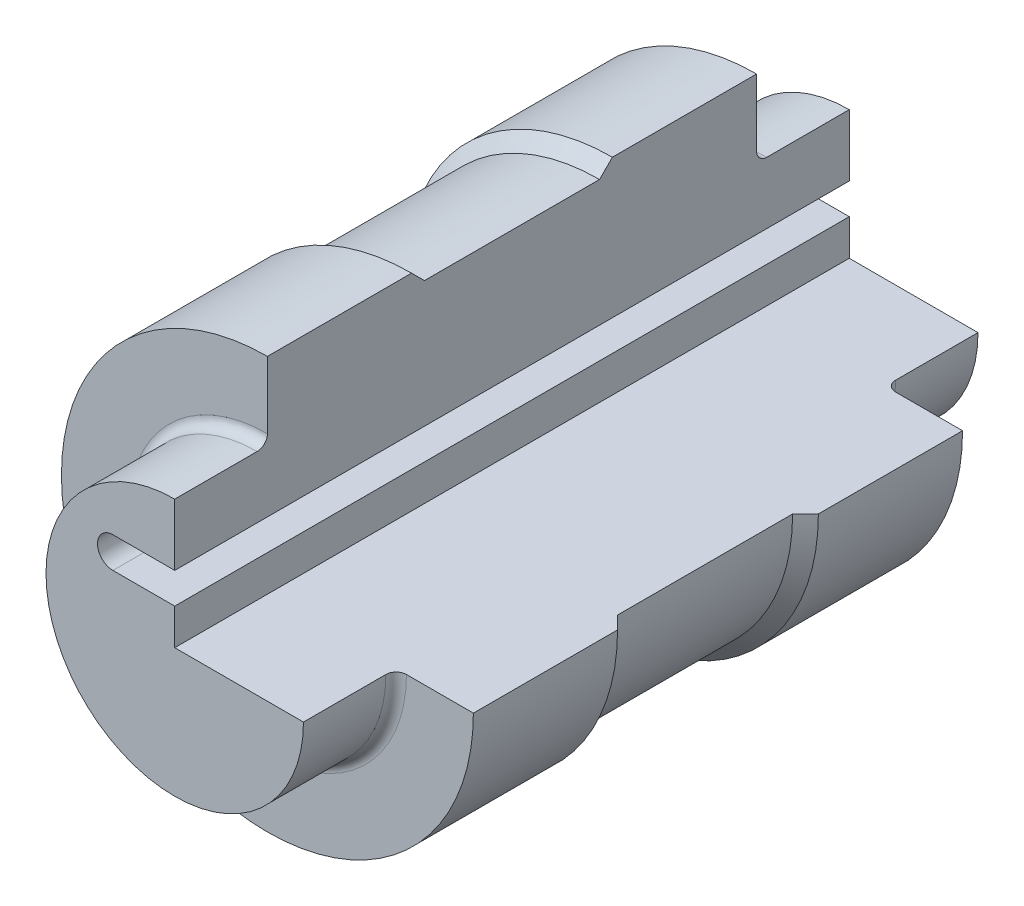
ISO-10303-21;
HEADER;
FILE_DESCRIPTION(('STEP AP214'),'2;1');
FILE_NAME('part.step','',(''),(''),'','','');
FILE_SCHEMA(('AUTOMOTIVE_DESIGN { 1 0 10303 214 1 1 1 1 }'));
ENDSEC;
DATA;
#1=APPLICATION_CONTEXT('core data for automotive mechanical design processes');
#2=APPLICATION_PROTOCOL_DEFINITION('international standard','automotive_design',2000,#1);
#3=PRODUCT_CONTEXT('',#1,'mechanical');
#4=PRODUCT('Part','Part','',(#3));
#5=PRODUCT_RELATED_PRODUCT_CATEGORY('part','',(#4));
#6=PRODUCT_DEFINITION_FORMATION('','',#4);
#7=PRODUCT_DEFINITION_CONTEXT('part definition',#1,'design');
#8=PRODUCT_DEFINITION('design','',#6,#7);
#9=PRODUCT_DEFINITION_SHAPE('','',#8);
#10=(LENGTH_UNIT() NAMED_UNIT(*) SI_UNIT(.MILLI.,.METRE.));
#11=(NAMED_UNIT(*) PLANE_ANGLE_UNIT() SI_UNIT($,.RADIAN.));
#12=(NAMED_UNIT(*) SI_UNIT($,.STERADIAN.) SOLID_ANGLE_UNIT());
#13=UNCERTAINTY_MEASURE_WITH_UNIT(LENGTH_MEASURE(1.E-05),#10,'distance_accuracy_value','');
#14=(GEOMETRIC_REPRESENTATION_CONTEXT(3) GLOBAL_UNCERTAINTY_ASSIGNED_CONTEXT((#13)) GLOBAL_UNIT_ASSIGNED_CONTEXT((#10,
#11,#12)) REPRESENTATION_CONTEXT('',''));
#15=CARTESIAN_POINT('',(0.,0.,0.));
#16=DIRECTION('',(0.,0.,1.));
#17=DIRECTION('',(1.,0.,0.));
#18=AXIS2_PLACEMENT_3D('',#15,#16,#17);
#19=CARTESIAN_POINT('',(0.,0.,-65.5));
#20=DIRECTION('',(0.,0.,-1.));
#21=DIRECTION('',(0.,1.,0.));
#22=AXIS2_PLACEMENT_3D('',#19,#20,#21);
#23=CYLINDRICAL_SURFACE('',#22,25.);
#24=DIRECTION('',(0.,0.,-1.));
#25=VECTOR('',#24,1.);
#26=CARTESIAN_POINT('',(0.,25.,-65.5));
#27=LINE('',#26,#25);
#28=CARTESIAN_POINT('',(0.,25.,-65.5));
#29=VERTEX_POINT('',#28);
#30=CARTESIAN_POINT('',(0.,25.,-49.5));
#31=VERTEX_POINT('',#30);
#32=EDGE_CURVE('E269',#29,#31,#27,.F.);
#33=ORIENTED_EDGE('',*,*,#32,.F.);
#34=CARTESIAN_POINT('',(0.,0.,-65.5));
#35=DIRECTION('',(0.,0.,-1.));
#36=DIRECTION('',(0.,1.,0.));
#37=AXIS2_PLACEMENT_3D('',#34,#35,#36);
#38=CIRCLE('',#37,25.);
#39=CARTESIAN_POINT('',(25.,0.,-65.5));
#40=VERTEX_POINT('',#39);
#41=EDGE_CURVE('E331',#40,#29,#38,.T.);
#42=ORIENTED_EDGE('',*,*,#41,.F.);
#43=DIRECTION('',(0.,0.,-1.));
#44=VECTOR('',#43,1.);
#45=CARTESIAN_POINT('',(25.,0.,-65.5));
#46=LINE('',#45,#44);
#47=CARTESIAN_POINT('',(25.,0.,-49.5));
#48=VERTEX_POINT('',#47);
#49=EDGE_CURVE('E245',#48,#40,#46,.T.);
#50=ORIENTED_EDGE('',*,*,#49,.F.);
#51=CARTESIAN_POINT('',(0.,0.,-49.5));
#52=DIRECTION('',(0.,0.,-1.));
#53=DIRECTION('',(0.,1.,0.));
#54=AXIS2_PLACEMENT_3D('',#51,#52,#53);
#55=CIRCLE('',#54,25.);
#56=EDGE_CURVE('E289',#48,#31,#55,.T.);
#57=ORIENTED_EDGE('',*,*,#56,.T.);
#58=EDGE_LOOP('',(#33,#42,#50,#57));
#59=FACE_BOUND('',#58,.T.);
#60=ADVANCED_FACE('F41',(#59),#23,.T.);
#61=CARTESIAN_POINT('',(0.,0.,-65.5));
#62=DIRECTION('',(0.,0.,-1.));
#63=DIRECTION('',(0.,1.,0.));
#64=AXIS2_PLACEMENT_3D('',#61,#62,#63);
#65=PLANE('',#64);
#66=DIRECTION('',(0.,-1.,0.));
#67=VECTOR('',#66,1.);
#68=CARTESIAN_POINT('',(0.,40.,-65.5));
#69=LINE('',#68,#67);
#70=CARTESIAN_POINT('',(0.,13.,-65.5));
#71=VERTEX_POINT('',#70);
#72=EDGE_CURVE('E208',#29,#71,#69,.T.);
#73=ORIENTED_EDGE('',*,*,#72,.T.);
#74=DIRECTION('',(-1.,0.,0.));
#75=VECTOR('',#74,1.);
#76=CARTESIAN_POINT('',(-12.,13.,-65.5));
#77=LINE('',#76,#75);
#78=CARTESIAN_POINT('',(-12.,13.,-65.5));
#79=VERTEX_POINT('',#78);
#80=EDGE_CURVE('E212',#71,#79,#77,.T.);
#81=ORIENTED_EDGE('',*,*,#80,.T.);
#82=CARTESIAN_POINT('',(-12.,10.,-65.5));
#83=DIRECTION('',(0.,0.,1.));
#84=DIRECTION('',(1.,0.,0.));
#85=AXIS2_PLACEMENT_3D('',#82,#83,#84);
#86=CIRCLE('',#85,3.);
#87=CARTESIAN_POINT('',(-12.,7.,-65.5));
#88=VERTEX_POINT('',#87);
#89=EDGE_CURVE('E216',#79,#88,#86,.T.);
#90=ORIENTED_EDGE('',*,*,#89,.T.);
#91=DIRECTION('',(1.,0.,0.));
#92=VECTOR('',#91,1.);
#93=CARTESIAN_POINT('',(-12.,7.,-65.5));
#94=LINE('',#93,#92);
#95=CARTESIAN_POINT('',(0.,7.,-65.5));
#96=VERTEX_POINT('',#95);
#97=EDGE_CURVE('E170',#88,#96,#94,.T.);
#98=ORIENTED_EDGE('',*,*,#97,.T.);
#99=DIRECTION('',(0.,-1.,0.));
#100=VECTOR('',#99,1.);
#101=CARTESIAN_POINT('',(0.,7.,-65.5));
#102=LINE('',#101,#100);
#103=CARTESIAN_POINT('',(0.,0.,-65.5));
#104=VERTEX_POINT('',#103);
#105=EDGE_CURVE('E203',#96,#104,#102,.T.);
#106=ORIENTED_EDGE('',*,*,#105,.T.);
#107=DIRECTION('',(1.,0.,0.));
#108=VECTOR('',#107,1.);
#109=CARTESIAN_POINT('',(0.,0.,-65.5));
#110=LINE('',#109,#108);
#111=EDGE_CURVE('E164',#104,#40,#110,.T.);
#112=ORIENTED_EDGE('',*,*,#111,.T.);
#113=ORIENTED_EDGE('',*,*,#41,.T.);
#114=EDGE_LOOP('',(#73,#81,#90,#98,#106,#112,#113));
#115=FACE_BOUND('',#114,.T.);
#116=ADVANCED_FACE('F393',(#115),#65,.T.);
#117=CARTESIAN_POINT('',(0.,0.,65.5));
#118=DIRECTION('',(0.,0.,1.));
#119=DIRECTION('',(0.,-1.,0.));
#120=AXIS2_PLACEMENT_3D('',#117,#118,#119);
#121=PLANE('',#120);
#122=DIRECTION('',(0.,-1.,0.));
#123=VECTOR('',#122,1.);
#124=CARTESIAN_POINT('',(0.,40.,65.5));
#125=LINE('',#124,#123);
#126=CARTESIAN_POINT('',(0.,25.,65.5));
#127=VERTEX_POINT('',#126);
#128=CARTESIAN_POINT('',(0.,13.,65.5));
#129=VERTEX_POINT('',#128);
#130=EDGE_CURVE('E187',#127,#129,#125,.T.);
#131=ORIENTED_EDGE('',*,*,#130,.F.);
#132=CARTESIAN_POINT('',(0.,0.,65.5));
#133=DIRECTION('',(0.,0.,-1.));
#134=DIRECTION('',(0.,1.,0.));
#135=AXIS2_PLACEMENT_3D('',#132,#133,#134);
#136=CIRCLE('',#135,25.);
#137=CARTESIAN_POINT('',(25.,0.,65.5));
#138=VERTEX_POINT('',#137);
#139=EDGE_CURVE('E185',#138,#127,#136,.T.);
#140=ORIENTED_EDGE('',*,*,#139,.F.);
#141=DIRECTION('',(1.,0.,0.));
#142=VECTOR('',#141,1.);
#143=CARTESIAN_POINT('',(0.,0.,65.5));
#144=LINE('',#143,#142);
#145=CARTESIAN_POINT('',(0.,0.,65.5));
#146=VERTEX_POINT('',#145);
#147=EDGE_CURVE('E161',#146,#138,#144,.T.);
#148=ORIENTED_EDGE('',*,*,#147,.F.);
#149=DIRECTION('',(0.,-1.,0.));
#150=VECTOR('',#149,1.);
#151=CARTESIAN_POINT('',(0.,7.,65.5));
#152=LINE('',#151,#150);
#153=CARTESIAN_POINT('',(0.,7.,65.5));
#154=VERTEX_POINT('',#153);
#155=EDGE_CURVE('E173',#154,#146,#152,.T.);
#156=ORIENTED_EDGE('',*,*,#155,.F.);
#157=DIRECTION('',(1.,0.,0.));
#158=VECTOR('',#157,1.);
#159=CARTESIAN_POINT('',(-12.,7.,65.5));
#160=LINE('',#159,#158);
#161=CARTESIAN_POINT('',(-12.,7.,65.5));
#162=VERTEX_POINT('',#161);
#163=EDGE_CURVE('E200',#162,#154,#160,.T.);
#164=ORIENTED_EDGE('',*,*,#163,.F.);
#165=CARTESIAN_POINT('',(-12.,10.,65.5));
#166=DIRECTION('',(0.,0.,1.));
#167=DIRECTION('',(1.,0.,0.));
#168=AXIS2_PLACEMENT_3D('',#165,#166,#167);
#169=CIRCLE('',#168,3.);
#170=CARTESIAN_POINT('',(-12.,13.,65.5));
#171=VERTEX_POINT('',#170);
#172=EDGE_CURVE('E196',#171,#162,#169,.T.);
#173=ORIENTED_EDGE('',*,*,#172,.F.);
#174=DIRECTION('',(-1.,0.,0.));
#175=VECTOR('',#174,1.);
#176=CARTESIAN_POINT('',(-12.,13.,65.5));
#177=LINE('',#176,#175);
#178=EDGE_CURVE('E190',#129,#171,#177,.T.);
#179=ORIENTED_EDGE('',*,*,#178,.F.);
#180=EDGE_LOOP('',(#131,#140,#148,#156,#164,#173,#179));
#181=FACE_BOUND('',#180,.T.);
#182=ADVANCED_FACE('F183',(#181),#121,.T.);
#183=CARTESIAN_POINT('',(0.,0.,-65.5));
#184=DIRECTION('',(0.,0.,-1.));
#185=DIRECTION('',(0.,1.,0.));
#186=AXIS2_PLACEMENT_3D('',#183,#184,#185);
#187=CYLINDRICAL_SURFACE('',#186,25.);
#188=DIRECTION('',(0.,0.,-1.));
#189=VECTOR('',#188,1.);
#190=CARTESIAN_POINT('',(0.,25.,-65.5));
#191=LINE('',#190,#189);
#192=CARTESIAN_POINT('',(0.,25.,49.5));
#193=VERTEX_POINT('',#192);
#194=EDGE_CURVE('E286',#193,#127,#191,.F.);
#195=ORIENTED_EDGE('',*,*,#194,.F.);
#196=CARTESIAN_POINT('',(0.,0.,49.5));
#197=DIRECTION('',(0.,0.,-1.));
#198=DIRECTION('',(0.,1.,0.));
#199=AXIS2_PLACEMENT_3D('',#196,#197,#198);
#200=CIRCLE('',#199,25.);
#201=CARTESIAN_POINT('',(25.,0.,49.5));
#202=VERTEX_POINT('',#201);
#203=EDGE_CURVE('E325',#202,#193,#200,.T.);
#204=ORIENTED_EDGE('',*,*,#203,.F.);
#205=DIRECTION('',(0.,0.,-1.));
#206=VECTOR('',#205,1.);
#207=CARTESIAN_POINT('',(25.,0.,-65.5));
#208=LINE('',#207,#206);
#209=EDGE_CURVE('E263',#138,#202,#208,.T.);
#210=ORIENTED_EDGE('',*,*,#209,.F.);
#211=ORIENTED_EDGE('',*,*,#139,.T.);
#212=EDGE_LOOP('',(#195,#204,#210,#211));
#213=FACE_BOUND('',#212,.T.);
#214=ADVANCED_FACE('F385',(#213),#187,.T.);
#215=CARTESIAN_POINT('',(0.,0.,49.5));
#216=DIRECTION('',(0.,0.,-1.));
#217=DIRECTION('',(0.,1.,0.));
#218=AXIS2_PLACEMENT_3D('',#215,#216,#217);
#219=TOROIDAL_SURFACE('',#218,27.,2.);
#220=CARTESIAN_POINT('',(0.,27.,49.5));
#221=DIRECTION('',(-1.,0.,0.));
#222=DIRECTION('',(0.,0.,1.));
#223=AXIS2_PLACEMENT_3D('',#220,#221,#222);
#224=CIRCLE('',#223,2.);
#225=CARTESIAN_POINT('',(0.,27.,47.5));
#226=VERTEX_POINT('',#225);
#227=EDGE_CURVE('E64',#226,#193,#224,.T.);
#228=ORIENTED_EDGE('',*,*,#227,.F.);
#229=CARTESIAN_POINT('',(0.,0.,47.5));
#230=DIRECTION('',(0.,0.,-1.));
#231=DIRECTION('',(0.,1.,0.));
#232=AXIS2_PLACEMENT_3D('',#229,#230,#231);
#233=CIRCLE('',#232,27.);
#234=CARTESIAN_POINT('',(27.,0.,47.5));
#235=VERTEX_POINT('',#234);
#236=EDGE_CURVE('E321',#235,#226,#233,.T.);
#237=ORIENTED_EDGE('',*,*,#236,.F.);
#238=CARTESIAN_POINT('',(27.,0.,49.5));
#239=DIRECTION('',(0.,-1.,0.));
#240=DIRECTION('',(1.,0.,0.));
#241=AXIS2_PLACEMENT_3D('',#238,#239,#240);
#242=CIRCLE('',#241,2.);
#243=EDGE_CURVE('E260',#202,#235,#242,.T.);
#244=ORIENTED_EDGE('',*,*,#243,.F.);
#245=ORIENTED_EDGE('',*,*,#203,.T.);
#246=EDGE_LOOP('',(#228,#237,#244,#245));
#247=FACE_BOUND('',#246,.T.);
#248=ADVANCED_FACE('F382',(#247),#219,.F.);
#249=CARTESIAN_POINT('',(0.,40.,47.5));
#250=DIRECTION('',(0.,0.,1.));
#251=DIRECTION('',(0.,-1.,0.));
#252=AXIS2_PLACEMENT_3D('',#249,#250,#251);
#253=PLANE('',#252);
#254=DIRECTION('',(0.,-1.,0.));
#255=VECTOR('',#254,1.);
#256=CARTESIAN_POINT('',(0.,40.,47.5));
#257=LINE('',#256,#255);
#258=CARTESIAN_POINT('',(0.,40.,47.5));
#259=VERTEX_POINT('',#258);
#260=EDGE_CURVE('E281',#259,#226,#257,.T.);
#261=ORIENTED_EDGE('',*,*,#260,.F.);
#262=CARTESIAN_POINT('',(0.,0.,47.5));
#263=DIRECTION('',(0.,0.,-1.));
#264=DIRECTION('',(0.,1.,0.));
#265=AXIS2_PLACEMENT_3D('',#262,#263,#264);
#266=CIRCLE('',#265,40.);
#267=CARTESIAN_POINT('',(40.,0.,47.5));
#268=VERTEX_POINT('',#267);
#269=EDGE_CURVE('E317',#268,#259,#266,.T.);
#270=ORIENTED_EDGE('',*,*,#269,.F.);
#271=DIRECTION('',(1.,0.,0.));
#272=VECTOR('',#271,1.);
#273=CARTESIAN_POINT('',(0.,0.,47.5));
#274=LINE('',#273,#272);
#275=EDGE_CURVE('E257',#235,#268,#274,.T.);
#276=ORIENTED_EDGE('',*,*,#275,.F.);
#277=ORIENTED_EDGE('',*,*,#236,.T.);
#278=EDGE_LOOP('',(#261,#270,#276,#277));
#279=FACE_BOUND('',#278,.T.);
#280=ADVANCED_FACE('F377',(#279),#253,.T.);
#281=CARTESIAN_POINT('',(0.,0.,-65.5));
#282=DIRECTION('',(0.,0.,-1.));
#283=DIRECTION('',(0.,1.,0.));
#284=AXIS2_PLACEMENT_3D('',#281,#282,#283);
#285=CYLINDRICAL_SURFACE('',#284,40.);
#286=DIRECTION('',(0.,0.,1.));
#287=VECTOR('',#286,1.);
#288=CARTESIAN_POINT('',(0.,40.,-65.5));
#289=LINE('',#288,#287);
#290=CARTESIAN_POINT('',(0.,40.,19.5));
#291=VERTEX_POINT('',#290);
#292=EDGE_CURVE('E236',#291,#259,#289,.T.);
#293=ORIENTED_EDGE('',*,*,#292,.F.);
#294=CARTESIAN_POINT('',(0.,0.,19.5));
#295=DIRECTION('',(0.,0.,-1.));
#296=DIRECTION('',(0.,1.,0.));
#297=AXIS2_PLACEMENT_3D('',#294,#295,#296);
#298=CIRCLE('',#297,40.);
#299=CARTESIAN_POINT('',(40.,0.,19.5));
#300=VERTEX_POINT('',#299);
#301=EDGE_CURVE('E313',#300,#291,#298,.T.);
#302=ORIENTED_EDGE('',*,*,#301,.F.);
#303=DIRECTION('',(0.,0.,1.));
#304=VECTOR('',#303,1.);
#305=CARTESIAN_POINT('',(40.,0.,-65.5));
#306=LINE('',#305,#304);
#307=EDGE_CURVE('E169',#300,#268,#306,.T.);
#308=ORIENTED_EDGE('',*,*,#307,.T.);
#309=ORIENTED_EDGE('',*,*,#269,.T.);
#310=EDGE_LOOP('',(#293,#302,#308,#309));
#311=FACE_BOUND('',#310,.T.);
#312=ADVANCED_FACE('F373',(#311),#285,.T.);
#313=CARTESIAN_POINT('',(0.,0.,17.));
#314=DIRECTION('',(0.,0.,1.));
#315=DIRECTION('',(0.,-1.,0.));
#316=AXIS2_PLACEMENT_3D('',#313,#314,#315);
#317=CONICAL_SURFACE('',#316,37.5,0.785398163397448);
#318=DIRECTION('',(0.,-0.707106781186547,-0.707106781186548));
#319=VECTOR('',#318,1.);
#320=CARTESIAN_POINT('',(0.,0.,-20.5));
#321=LINE('',#320,#319);
#322=CARTESIAN_POINT('',(0.,37.5,17.));
#323=VERTEX_POINT('',#322);
#324=EDGE_CURVE('E278',#323,#291,#321,.F.);
#325=ORIENTED_EDGE('',*,*,#324,.F.);
#326=CARTESIAN_POINT('',(0.,0.,17.));
#327=DIRECTION('',(0.,0.,-1.));
#328=DIRECTION('',(0.,1.,0.));
#329=AXIS2_PLACEMENT_3D('',#326,#327,#328);
#330=CIRCLE('',#329,37.5);
#331=CARTESIAN_POINT('',(37.5,0.,17.));
#332=VERTEX_POINT('',#331);
#333=EDGE_CURVE('E309',#332,#323,#330,.T.);
#334=ORIENTED_EDGE('',*,*,#333,.F.);
#335=DIRECTION('',(0.707106781186547,0.,0.707106781186548));
#336=VECTOR('',#335,1.);
#337=CARTESIAN_POINT('',(0.,0.,-20.5));
#338=LINE('',#337,#336);
#339=EDGE_CURVE('E254',#300,#332,#338,.F.);
#340=ORIENTED_EDGE('',*,*,#339,.F.);
#341=ORIENTED_EDGE('',*,*,#301,.T.);
#342=EDGE_LOOP('',(#325,#334,#340,#341));
#343=FACE_BOUND('',#342,.T.);
#344=ADVANCED_FACE('F369',(#343),#317,.T.);
#345=CARTESIAN_POINT('',(0.,0.,-65.5));
#346=DIRECTION('',(0.,0.,-1.));
#347=DIRECTION('',(0.,1.,0.));
#348=AXIS2_PLACEMENT_3D('',#345,#346,#347);
#349=CYLINDRICAL_SURFACE('',#348,37.5);
#350=DIRECTION('',(0.,0.,-1.));
#351=VECTOR('',#350,1.);
#352=CARTESIAN_POINT('',(0.,37.5,-65.5));
#353=LINE('',#352,#351);
#354=CARTESIAN_POINT('',(0.,37.5,-17.));
#355=VERTEX_POINT('',#354);
#356=EDGE_CURVE('E275',#355,#323,#353,.F.);
#357=ORIENTED_EDGE('',*,*,#356,.F.);
#358=CARTESIAN_POINT('',(0.,0.,-17.));
#359=DIRECTION('',(0.,0.,-1.));
#360=DIRECTION('',(0.,1.,0.));
#361=AXIS2_PLACEMENT_3D('',#358,#359,#360);
#362=CIRCLE('',#361,37.5);
#363=CARTESIAN_POINT('',(37.5,0.,-17.));
#364=VERTEX_POINT('',#363);
#365=EDGE_CURVE('E305',#364,#355,#362,.T.);
#366=ORIENTED_EDGE('',*,*,#365,.F.);
#367=DIRECTION('',(0.,0.,-1.));
#368=VECTOR('',#367,1.);
#369=CARTESIAN_POINT('',(37.5,0.,-65.5));
#370=LINE('',#369,#368);
#371=EDGE_CURVE('E251',#332,#364,#370,.T.);
#372=ORIENTED_EDGE('',*,*,#371,.F.);
#373=ORIENTED_EDGE('',*,*,#333,.T.);
#374=EDGE_LOOP('',(#357,#366,#372,#373));
#375=FACE_BOUND('',#374,.T.);
#376=ADVANCED_FACE('F364',(#375),#349,.T.);
#377=CARTESIAN_POINT('',(0.,0.,-19.5));
#378=DIRECTION('',(0.,0.,-1.));
#379=DIRECTION('',(0.,1.,0.));
#380=AXIS2_PLACEMENT_3D('',#377,#378,#379);
#381=CONICAL_SURFACE('',#380,40.,0.785398163397447);
#382=DIRECTION('',(0.,0.707106781186547,-0.707106781186548));
#383=VECTOR('',#382,1.);
#384=CARTESIAN_POINT('',(0.,0.,20.5000000000001));
#385=LINE('',#384,#383);
#386=CARTESIAN_POINT('',(0.,40.,-19.5));
#387=VERTEX_POINT('',#386);
#388=EDGE_CURVE('E272',#387,#355,#385,.F.);
#389=ORIENTED_EDGE('',*,*,#388,.F.);
#390=CARTESIAN_POINT('',(0.,0.,-19.5));
#391=DIRECTION('',(0.,0.,-1.));
#392=DIRECTION('',(0.,1.,0.));
#393=AXIS2_PLACEMENT_3D('',#390,#391,#392);
#394=CIRCLE('',#393,40.);
#395=CARTESIAN_POINT('',(40.,0.,-19.5));
#396=VERTEX_POINT('',#395);
#397=EDGE_CURVE('E301',#396,#387,#394,.T.);
#398=ORIENTED_EDGE('',*,*,#397,.F.);
#399=DIRECTION('',(-0.707106781186547,0.,0.707106781186548));
#400=VECTOR('',#399,1.);
#401=CARTESIAN_POINT('',(0.,0.,20.5000000000001));
#402=LINE('',#401,#400);
#403=EDGE_CURVE('E248',#364,#396,#402,.F.);
#404=ORIENTED_EDGE('',*,*,#403,.F.);
#405=ORIENTED_EDGE('',*,*,#365,.T.);
#406=EDGE_LOOP('',(#389,#398,#404,#405));
#407=FACE_BOUND('',#406,.T.);
#408=ADVANCED_FACE('F359',(#407),#381,.T.);
#409=CARTESIAN_POINT('',(0.,0.,-65.5));
#410=DIRECTION('',(0.,0.,-1.));
#411=DIRECTION('',(0.,1.,0.));
#412=AXIS2_PLACEMENT_3D('',#409,#410,#411);
#413=CYLINDRICAL_SURFACE('',#412,40.);
#414=CARTESIAN_POINT('',(0.,40.,-47.5));
#415=VERTEX_POINT('',#414);
#416=EDGE_CURVE('E235',#415,#387,#289,.T.);
#417=ORIENTED_EDGE('',*,*,#416,.F.);
#418=CARTESIAN_POINT('',(0.,0.,-47.5));
#419=DIRECTION('',(0.,0.,-1.));
#420=DIRECTION('',(0.,1.,0.));
#421=AXIS2_PLACEMENT_3D('',#418,#419,#420);
#422=CIRCLE('',#421,40.);
#423=CARTESIAN_POINT('',(40.,0.,-47.5));
#424=VERTEX_POINT('',#423);
#425=EDGE_CURVE('E297',#424,#415,#422,.T.);
#426=ORIENTED_EDGE('',*,*,#425,.F.);
#427=EDGE_CURVE('E239',#424,#396,#306,.T.);
#428=ORIENTED_EDGE('',*,*,#427,.T.);
#429=ORIENTED_EDGE('',*,*,#397,.T.);
#430=EDGE_LOOP('',(#417,#426,#428,#429));
#431=FACE_BOUND('',#430,.T.);
#432=ADVANCED_FACE('F352',(#431),#413,.T.);
#433=CARTESIAN_POINT('',(0.,40.,-47.5));
#434=DIRECTION('',(0.,0.,-1.));
#435=DIRECTION('',(0.,1.,0.));
#436=AXIS2_PLACEMENT_3D('',#433,#434,#435);
#437=PLANE('',#436);
#438=DIRECTION('',(0.,1.,0.));
#439=VECTOR('',#438,1.);
#440=CARTESIAN_POINT('',(0.,40.,-47.5));
#441=LINE('',#440,#439);
#442=CARTESIAN_POINT('',(0.,27.,-47.5));
#443=VERTEX_POINT('',#442);
#444=EDGE_CURVE('E266',#443,#415,#441,.T.);
#445=ORIENTED_EDGE('',*,*,#444,.F.);
#446=CARTESIAN_POINT('',(0.,0.,-47.5));
#447=DIRECTION('',(0.,0.,-1.));
#448=DIRECTION('',(0.,1.,0.));
#449=AXIS2_PLACEMENT_3D('',#446,#447,#448);
#450=CIRCLE('',#449,27.);
#451=CARTESIAN_POINT('',(27.,0.,-47.5));
#452=VERTEX_POINT('',#451);
#453=EDGE_CURVE('E293',#452,#443,#450,.T.);
#454=ORIENTED_EDGE('',*,*,#453,.F.);
#455=DIRECTION('',(-1.,0.,0.));
#456=VECTOR('',#455,1.);
#457=CARTESIAN_POINT('',(0.,0.,-47.5));
#458=LINE('',#457,#456);
#459=EDGE_CURVE('E56',#424,#452,#458,.T.);
#460=ORIENTED_EDGE('',*,*,#459,.F.);
#461=ORIENTED_EDGE('',*,*,#425,.T.);
#462=EDGE_LOOP('',(#445,#454,#460,#461));
#463=FACE_BOUND('',#462,.T.);
#464=ADVANCED_FACE('F348',(#463),#437,.T.);
#465=CARTESIAN_POINT('',(0.,0.,-49.5));
#466=DIRECTION('',(0.,0.,-1.));
#467=DIRECTION('',(0.,1.,0.));
#468=AXIS2_PLACEMENT_3D('',#465,#466,#467);
#469=TOROIDAL_SURFACE('',#468,27.,2.);
#470=CARTESIAN_POINT('',(0.,27.,-49.5));
#471=DIRECTION('',(-1.,0.,0.));
#472=DIRECTION('',(0.,0.,1.));
#473=AXIS2_PLACEMENT_3D('',#470,#471,#472);
#474=CIRCLE('',#473,2.);
#475=EDGE_CURVE('E11',#31,#443,#474,.T.);
#476=ORIENTED_EDGE('',*,*,#475,.F.);
#477=ORIENTED_EDGE('',*,*,#56,.F.);
#478=CARTESIAN_POINT('',(27.,0.,-49.5));
#479=DIRECTION('',(0.,-1.,0.));
#480=DIRECTION('',(1.,0.,0.));
#481=AXIS2_PLACEMENT_3D('',#478,#479,#480);
#482=CIRCLE('',#481,2.);
#483=EDGE_CURVE('E49',#452,#48,#482,.T.);
#484=ORIENTED_EDGE('',*,*,#483,.F.);
#485=ORIENTED_EDGE('',*,*,#453,.T.);
#486=EDGE_LOOP('',(#476,#477,#484,#485));
#487=FACE_BOUND('',#486,.T.);
#488=ADVANCED_FACE('F343',(#487),#469,.F.);
#489=CARTESIAN_POINT('',(0.,7.,-65.5));
#490=DIRECTION('',(-1.,0.,0.));
#491=DIRECTION('',(0.,0.,1.));
#492=AXIS2_PLACEMENT_3D('',#489,#490,#491);
#493=PLANE('',#492);
#494=DIRECTION('',(0.,0.,1.));
#495=VECTOR('',#494,1.);
#496=CARTESIAN_POINT('',(0.,0.,-65.5));
#497=LINE('',#496,#495);
#498=EDGE_CURVE('E157',#104,#146,#497,.T.);
#499=ORIENTED_EDGE('',*,*,#498,.F.);
#500=ORIENTED_EDGE('',*,*,#105,.F.);
#501=DIRECTION('',(0.,0.,1.));
#502=VECTOR('',#501,1.);
#503=CARTESIAN_POINT('',(0.,7.,-65.5));
#504=LINE('',#503,#502);
#505=EDGE_CURVE('E175',#96,#154,#504,.T.);
#506=ORIENTED_EDGE('',*,*,#505,.T.);
#507=ORIENTED_EDGE('',*,*,#155,.T.);
#508=EDGE_LOOP('',(#499,#500,#506,#507));
#509=FACE_BOUND('',#508,.T.);
#510=ADVANCED_FACE('F174',(#509),#493,.F.);
#511=CARTESIAN_POINT('',(-12.,7.,-65.5));
#512=DIRECTION('',(0.,-1.,0.));
#513=DIRECTION('',(1.,0.,0.));
#514=AXIS2_PLACEMENT_3D('',#511,#512,#513);
#515=PLANE('',#514);
#516=ORIENTED_EDGE('',*,*,#505,.F.);
#517=ORIENTED_EDGE('',*,*,#97,.F.);
#518=DIRECTION('',(0.,0.,1.));
#519=VECTOR('',#518,1.);
#520=CARTESIAN_POINT('',(-12.,7.,-65.5));
#521=LINE('',#520,#519);
#522=EDGE_CURVE('E225',#88,#162,#521,.T.);
#523=ORIENTED_EDGE('',*,*,#522,.T.);
#524=ORIENTED_EDGE('',*,*,#163,.T.);
#525=EDGE_LOOP('',(#516,#517,#523,#524));
#526=FACE_BOUND('',#525,.T.);
#527=ADVANCED_FACE('F396',(#526),#515,.F.);
#528=CARTESIAN_POINT('',(-12.,10.,-65.5));
#529=DIRECTION('',(0.,0.,1.));
#530=DIRECTION('',(1.,0.,0.));
#531=AXIS2_PLACEMENT_3D('',#528,#529,#530);
#532=CYLINDRICAL_SURFACE('',#531,3.);
#533=ORIENTED_EDGE('',*,*,#522,.F.);
#534=ORIENTED_EDGE('',*,*,#89,.F.);
#535=DIRECTION('',(0.,0.,1.));
#536=VECTOR('',#535,1.);
#537=CARTESIAN_POINT('',(-12.,13.,-65.5));
#538=LINE('',#537,#536);
#539=EDGE_CURVE('E228',#79,#171,#538,.T.);
#540=ORIENTED_EDGE('',*,*,#539,.T.);
#541=ORIENTED_EDGE('',*,*,#172,.T.);
#542=EDGE_LOOP('',(#533,#534,#540,#541));
#543=FACE_BOUND('',#542,.T.);
#544=ADVANCED_FACE('F398',(#543),#532,.F.);
#545=CARTESIAN_POINT('',(-12.,13.,-65.5));
#546=DIRECTION('',(0.,1.,0.));
#547=DIRECTION('',(0.,0.,1.));
#548=AXIS2_PLACEMENT_3D('',#545,#546,#547);
#549=PLANE('',#548);
#550=ORIENTED_EDGE('',*,*,#539,.F.);
#551=ORIENTED_EDGE('',*,*,#80,.F.);
#552=DIRECTION('',(0.,0.,1.));
#553=VECTOR('',#552,1.);
#554=CARTESIAN_POINT('',(0.,13.,-65.5));
#555=LINE('',#554,#553);
#556=EDGE_CURVE('E231',#71,#129,#555,.T.);
#557=ORIENTED_EDGE('',*,*,#556,.T.);
#558=ORIENTED_EDGE('',*,*,#178,.T.);
#559=EDGE_LOOP('',(#550,#551,#557,#558));
#560=FACE_BOUND('',#559,.T.);
#561=ADVANCED_FACE('F389',(#560),#549,.F.);
#562=CARTESIAN_POINT('',(0.,40.,-65.5));
#563=DIRECTION('',(-1.,0.,0.));
#564=DIRECTION('',(0.,0.,1.));
#565=AXIS2_PLACEMENT_3D('',#562,#563,#564);
#566=PLANE('',#565);
#567=ORIENTED_EDGE('',*,*,#194,.T.);
#568=ORIENTED_EDGE('',*,*,#130,.T.);
#569=ORIENTED_EDGE('',*,*,#556,.F.);
#570=ORIENTED_EDGE('',*,*,#72,.F.);
#571=ORIENTED_EDGE('',*,*,#32,.T.);
#572=ORIENTED_EDGE('',*,*,#475,.T.);
#573=ORIENTED_EDGE('',*,*,#444,.T.);
#574=ORIENTED_EDGE('',*,*,#416,.T.);
#575=ORIENTED_EDGE('',*,*,#388,.T.);
#576=ORIENTED_EDGE('',*,*,#356,.T.);
#577=ORIENTED_EDGE('',*,*,#324,.T.);
#578=ORIENTED_EDGE('',*,*,#292,.T.);
#579=ORIENTED_EDGE('',*,*,#260,.T.);
#580=ORIENTED_EDGE('',*,*,#227,.T.);
#581=EDGE_LOOP('',(#567,#568,#569,#570,#571,#572,#573,#574,#575,#576,#577,#578,#579,#580));
#582=FACE_BOUND('',#581,.T.);
#583=ADVANCED_FACE('F345',(#582),#566,.F.);
#584=CARTESIAN_POINT('',(0.,0.,-65.5));
#585=DIRECTION('',(0.,-1.,0.));
#586=DIRECTION('',(1.,0.,0.));
#587=AXIS2_PLACEMENT_3D('',#584,#585,#586);
#588=PLANE('',#587);
#589=ORIENTED_EDGE('',*,*,#209,.T.);
#590=ORIENTED_EDGE('',*,*,#243,.T.);
#591=ORIENTED_EDGE('',*,*,#275,.T.);
#592=ORIENTED_EDGE('',*,*,#307,.F.);
#593=ORIENTED_EDGE('',*,*,#339,.T.);
#594=ORIENTED_EDGE('',*,*,#371,.T.);
#595=ORIENTED_EDGE('',*,*,#403,.T.);
#596=ORIENTED_EDGE('',*,*,#427,.F.);
#597=ORIENTED_EDGE('',*,*,#459,.T.);
#598=ORIENTED_EDGE('',*,*,#483,.T.);
#599=ORIENTED_EDGE('',*,*,#49,.T.);
#600=ORIENTED_EDGE('',*,*,#111,.F.);
#601=ORIENTED_EDGE('',*,*,#498,.T.);
#602=ORIENTED_EDGE('',*,*,#147,.T.);
#603=EDGE_LOOP('',(#589,#590,#591,#592,#593,#594,#595,#596,#597,#598,#599,#600,#601,#602));
#604=FACE_BOUND('',#603,.T.);
#605=ADVANCED_FACE('F159',(#604),#588,.F.);
#606=CLOSED_SHELL('',(#60,#116,#182,#214,#248,#280,#312,#344,#376,#408,#432,#464,#488,#510,#527,
#544,#561,#583,#605));
#607=MANIFOLD_SOLID_BREP('B2',#606);
#608=ADVANCED_BREP_SHAPE_REPRESENTATION('',(#18,#607),#14);
#609=SHAPE_DEFINITION_REPRESENTATION(#9,#608);
ENDSEC;
END-ISO-10303-21;
